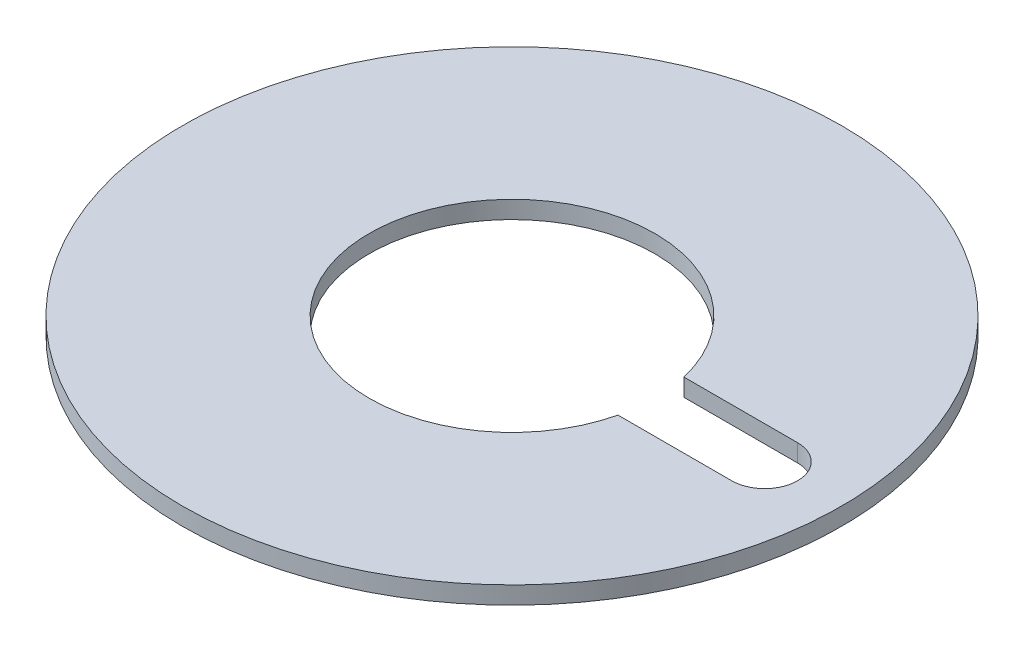
ISO-10303-21;
HEADER;
FILE_DESCRIPTION(('STEP AP214'),'2;1');
FILE_NAME('part.step','',(''),(''),'','','');
FILE_SCHEMA(('AUTOMOTIVE_DESIGN { 1 0 10303 214 1 1 1 1 }'));
ENDSEC;
DATA;
#1=APPLICATION_CONTEXT('core data for automotive mechanical design processes');
#2=APPLICATION_PROTOCOL_DEFINITION('international standard','automotive_design',2000,#1);
#3=PRODUCT_CONTEXT('',#1,'mechanical');
#4=PRODUCT('Part','Part','',(#3));
#5=PRODUCT_RELATED_PRODUCT_CATEGORY('part','',(#4));
#6=PRODUCT_DEFINITION_FORMATION('','',#4);
#7=PRODUCT_DEFINITION_CONTEXT('part definition',#1,'design');
#8=PRODUCT_DEFINITION('design','',#6,#7);
#9=PRODUCT_DEFINITION_SHAPE('','',#8);
#10=(LENGTH_UNIT() NAMED_UNIT(*) SI_UNIT(.MILLI.,.METRE.));
#11=(NAMED_UNIT(*) PLANE_ANGLE_UNIT() SI_UNIT($,.RADIAN.));
#12=(NAMED_UNIT(*) SI_UNIT($,.STERADIAN.) SOLID_ANGLE_UNIT());
#13=UNCERTAINTY_MEASURE_WITH_UNIT(LENGTH_MEASURE(1.E-05),#10,'distance_accuracy_value','');
#14=(GEOMETRIC_REPRESENTATION_CONTEXT(3) GLOBAL_UNCERTAINTY_ASSIGNED_CONTEXT((#13)) GLOBAL_UNIT_ASSIGNED_CONTEXT((#10,
#11,#12)) REPRESENTATION_CONTEXT('',''));
#15=CARTESIAN_POINT('',(0.,0.,0.));
#16=DIRECTION('',(0.,0.,1.));
#17=DIRECTION('',(1.,0.,0.));
#18=AXIS2_PLACEMENT_3D('',#15,#16,#17);
#19=CARTESIAN_POINT('',(0.,0.8,0.));
#20=DIRECTION('',(0.,-1.,0.));
#21=DIRECTION('',(0.,0.,-1.));
#22=AXIS2_PLACEMENT_3D('',#19,#20,#21);
#23=CYLINDRICAL_SURFACE('',#22,15.);
#24=CARTESIAN_POINT('',(0.,0.8,0.));
#25=DIRECTION('',(0.,1.,0.));
#26=DIRECTION('',(0.,0.,1.));
#27=AXIS2_PLACEMENT_3D('',#24,#25,#26);
#28=CIRCLE('',#27,15.);
#29=CARTESIAN_POINT('',(0.,0.8,15.));
#30=VERTEX_POINT('',#29);
#31=EDGE_CURVE('E12',#30,#30,#28,.T.);
#32=ORIENTED_EDGE('',*,*,#31,.F.);
#33=EDGE_LOOP('',(#32));
#34=FACE_BOUND('',#33,.T.);
#35=CARTESIAN_POINT('',(0.,0.,0.));
#36=DIRECTION('',(0.,1.,0.));
#37=DIRECTION('',(0.,0.,1.));
#38=AXIS2_PLACEMENT_3D('',#35,#36,#37);
#39=CIRCLE('',#38,15.);
#40=CARTESIAN_POINT('',(0.,0.,15.));
#41=VERTEX_POINT('',#40);
#42=EDGE_CURVE('E43',#41,#41,#39,.T.);
#43=ORIENTED_EDGE('',*,*,#42,.T.);
#44=EDGE_LOOP('',(#43));
#45=FACE_BOUND('',#44,.T.);
#46=ADVANCED_FACE('F40',(#34,#45),#23,.T.);
#47=CARTESIAN_POINT('',(0.,0.8,0.));
#48=DIRECTION('',(0.,1.,0.));
#49=DIRECTION('',(0.,0.,1.));
#50=AXIS2_PLACEMENT_3D('',#47,#48,#49);
#51=PLANE('',#50);
#52=CARTESIAN_POINT('',(11.5,0.8,0.));
#53=DIRECTION('',(0.,1.,0.));
#54=DIRECTION('',(0.,0.,-1.));
#55=AXIS2_PLACEMENT_3D('',#52,#53,#54);
#56=CIRCLE('',#55,1.5);
#57=CARTESIAN_POINT('',(11.5,0.8,1.5));
#58=VERTEX_POINT('',#57);
#59=CARTESIAN_POINT('',(11.5,0.8,-1.5));
#60=VERTEX_POINT('',#59);
#61=EDGE_CURVE('E54',#58,#60,#56,.T.);
#62=ORIENTED_EDGE('',*,*,#61,.F.);
#63=DIRECTION('',(1.,0.,0.));
#64=VECTOR('',#63,1.);
#65=CARTESIAN_POINT('',(6.32455532033676,0.8,1.5));
#66=LINE('',#65,#64);
#67=CARTESIAN_POINT('',(6.32455532033676,0.8,1.5));
#68=VERTEX_POINT('',#67);
#69=EDGE_CURVE('E98',#68,#58,#66,.T.);
#70=ORIENTED_EDGE('',*,*,#69,.F.);
#71=CARTESIAN_POINT('',(0.,0.8,0.));
#72=DIRECTION('',(0.,1.,0.));
#73=DIRECTION('',(0.,0.,1.));
#74=AXIS2_PLACEMENT_3D('',#71,#72,#73);
#75=CIRCLE('',#74,6.5);
#76=CARTESIAN_POINT('',(6.32455532033676,0.8,-1.5));
#77=VERTEX_POINT('',#76);
#78=EDGE_CURVE('E102',#77,#68,#75,.T.);
#79=ORIENTED_EDGE('',*,*,#78,.F.);
#80=DIRECTION('',(-1.,0.,0.));
#81=VECTOR('',#80,1.);
#82=CARTESIAN_POINT('',(6.32455532033676,0.8,-1.5));
#83=LINE('',#82,#81);
#84=EDGE_CURVE('E110',#60,#77,#83,.T.);
#85=ORIENTED_EDGE('',*,*,#84,.F.);
#86=EDGE_LOOP('',(#62,#70,#79,#85));
#87=FACE_BOUND('',#86,.T.);
#88=ORIENTED_EDGE('',*,*,#31,.T.);
#89=EDGE_LOOP('',(#88));
#90=FACE_BOUND('',#89,.T.);
#91=ADVANCED_FACE('F130',(#87,#90),#51,.T.);
#92=CARTESIAN_POINT('',(0.,0.,0.));
#93=DIRECTION('',(0.,1.,0.));
#94=DIRECTION('',(0.,0.,1.));
#95=AXIS2_PLACEMENT_3D('',#92,#93,#94);
#96=PLANE('',#95);
#97=DIRECTION('',(1.,0.,0.));
#98=VECTOR('',#97,1.);
#99=CARTESIAN_POINT('',(6.32455532033676,0.,1.5));
#100=LINE('',#99,#98);
#101=CARTESIAN_POINT('',(6.32455532033676,0.,1.5));
#102=VERTEX_POINT('',#101);
#103=CARTESIAN_POINT('',(11.5,0.,1.5));
#104=VERTEX_POINT('',#103);
#105=EDGE_CURVE('E88',#102,#104,#100,.T.);
#106=ORIENTED_EDGE('',*,*,#105,.T.);
#107=CARTESIAN_POINT('',(11.5,0.,0.));
#108=DIRECTION('',(0.,1.,0.));
#109=DIRECTION('',(0.,0.,-1.));
#110=AXIS2_PLACEMENT_3D('',#107,#108,#109);
#111=CIRCLE('',#110,1.5);
#112=CARTESIAN_POINT('',(11.5,0.,-1.5));
#113=VERTEX_POINT('',#112);
#114=EDGE_CURVE('E82',#104,#113,#111,.T.);
#115=ORIENTED_EDGE('',*,*,#114,.T.);
#116=DIRECTION('',(-1.,0.,0.));
#117=VECTOR('',#116,1.);
#118=CARTESIAN_POINT('',(6.32455532033676,0.,-1.5));
#119=LINE('',#118,#117);
#120=CARTESIAN_POINT('',(6.32455532033676,0.,-1.5));
#121=VERTEX_POINT('',#120);
#122=EDGE_CURVE('E91',#113,#121,#119,.T.);
#123=ORIENTED_EDGE('',*,*,#122,.T.);
#124=CARTESIAN_POINT('',(0.,0.,0.));
#125=DIRECTION('',(0.,1.,0.));
#126=DIRECTION('',(0.,0.,1.));
#127=AXIS2_PLACEMENT_3D('',#124,#125,#126);
#128=CIRCLE('',#127,6.5);
#129=EDGE_CURVE('E62',#121,#102,#128,.T.);
#130=ORIENTED_EDGE('',*,*,#129,.T.);
#131=EDGE_LOOP('',(#106,#115,#123,#130));
#132=FACE_BOUND('',#131,.T.);
#133=ORIENTED_EDGE('',*,*,#42,.F.);
#134=EDGE_LOOP('',(#133));
#135=FACE_BOUND('',#134,.T.);
#136=ADVANCED_FACE('F95',(#132,#135),#96,.F.);
#137=CARTESIAN_POINT('',(11.5,0.,0.));
#138=DIRECTION('',(0.,1.,0.));
#139=DIRECTION('',(0.,0.,1.));
#140=AXIS2_PLACEMENT_3D('',#137,#138,#139);
#141=CYLINDRICAL_SURFACE('',#140,1.5);
#142=ORIENTED_EDGE('',*,*,#61,.T.);
#143=DIRECTION('',(0.,1.,0.));
#144=VECTOR('',#143,1.);
#145=CARTESIAN_POINT('',(11.5,0.,-1.5));
#146=LINE('',#145,#144);
#147=EDGE_CURVE('E78',#113,#60,#146,.T.);
#148=ORIENTED_EDGE('',*,*,#147,.F.);
#149=ORIENTED_EDGE('',*,*,#114,.F.);
#150=DIRECTION('',(0.,1.,0.));
#151=VECTOR('',#150,1.);
#152=CARTESIAN_POINT('',(11.5,0.,1.5));
#153=LINE('',#152,#151);
#154=EDGE_CURVE('E119',#104,#58,#153,.T.);
#155=ORIENTED_EDGE('',*,*,#154,.T.);
#156=EDGE_LOOP('',(#142,#148,#149,#155));
#157=FACE_BOUND('',#156,.T.);
#158=ADVANCED_FACE('F80',(#157),#141,.F.);
#159=CARTESIAN_POINT('',(6.32455532033676,0.,1.5));
#160=DIRECTION('',(0.,0.,1.));
#161=DIRECTION('',(1.,0.,0.));
#162=AXIS2_PLACEMENT_3D('',#159,#160,#161);
#163=PLANE('',#162);
#164=ORIENTED_EDGE('',*,*,#69,.T.);
#165=ORIENTED_EDGE('',*,*,#154,.F.);
#166=ORIENTED_EDGE('',*,*,#105,.F.);
#167=DIRECTION('',(0.,1.,0.));
#168=VECTOR('',#167,1.);
#169=CARTESIAN_POINT('',(6.32455532033676,0.,1.5));
#170=LINE('',#169,#168);
#171=EDGE_CURVE('E121',#102,#68,#170,.T.);
#172=ORIENTED_EDGE('',*,*,#171,.T.);
#173=EDGE_LOOP('',(#164,#165,#166,#172));
#174=FACE_BOUND('',#173,.T.);
#175=ADVANCED_FACE('F134',(#174),#163,.F.);
#176=CARTESIAN_POINT('',(0.,0.,0.));
#177=DIRECTION('',(0.,1.,0.));
#178=DIRECTION('',(0.,0.,1.));
#179=AXIS2_PLACEMENT_3D('',#176,#177,#178);
#180=CYLINDRICAL_SURFACE('',#179,6.5);
#181=ORIENTED_EDGE('',*,*,#78,.T.);
#182=ORIENTED_EDGE('',*,*,#171,.F.);
#183=ORIENTED_EDGE('',*,*,#129,.F.);
#184=DIRECTION('',(0.,1.,0.));
#185=VECTOR('',#184,1.);
#186=CARTESIAN_POINT('',(6.32455532033676,0.,-1.5));
#187=LINE('',#186,#185);
#188=EDGE_CURVE('E87',#121,#77,#187,.T.);
#189=ORIENTED_EDGE('',*,*,#188,.T.);
#190=EDGE_LOOP('',(#181,#182,#183,#189));
#191=FACE_BOUND('',#190,.T.);
#192=ADVANCED_FACE('F125',(#191),#180,.F.);
#193=CARTESIAN_POINT('',(6.32455532033676,0.,-1.5));
#194=DIRECTION('',(0.,0.,-1.));
#195=DIRECTION('',(-1.,0.,0.));
#196=AXIS2_PLACEMENT_3D('',#193,#194,#195);
#197=PLANE('',#196);
#198=ORIENTED_EDGE('',*,*,#84,.T.);
#199=ORIENTED_EDGE('',*,*,#188,.F.);
#200=ORIENTED_EDGE('',*,*,#122,.F.);
#201=ORIENTED_EDGE('',*,*,#147,.T.);
#202=EDGE_LOOP('',(#198,#199,#200,#201));
#203=FACE_BOUND('',#202,.T.);
#204=ADVANCED_FACE('F92',(#203),#197,.F.);
#205=CLOSED_SHELL('',(#46,#91,#136,#158,#175,#192,#204));
#206=MANIFOLD_SOLID_BREP('B2',#205);
#207=ADVANCED_BREP_SHAPE_REPRESENTATION('',(#18,#206),#14);
#208=SHAPE_DEFINITION_REPRESENTATION(#9,#207);
ENDSEC;
END-ISO-10303-21;
